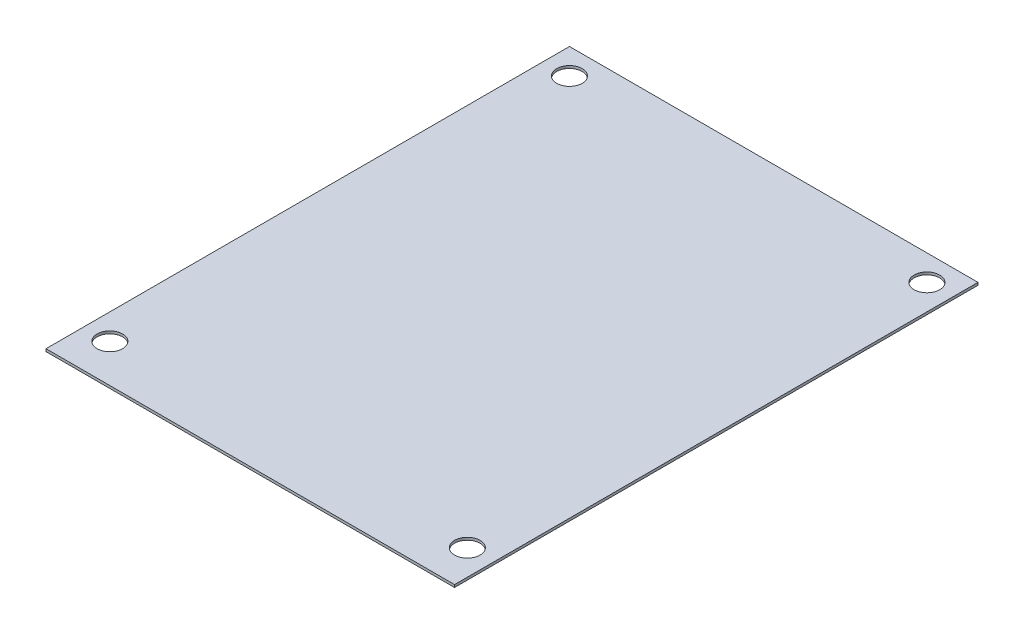
ISO-10303-21;
HEADER;
FILE_DESCRIPTION(('STEP AP214'),'2;1');
FILE_NAME('part.step','',(''),(''),'','','');
FILE_SCHEMA(('AUTOMOTIVE_DESIGN { 1 0 10303 214 1 1 1 1 }'));
ENDSEC;
DATA;
#1=APPLICATION_CONTEXT('core data for automotive mechanical design processes');
#2=APPLICATION_PROTOCOL_DEFINITION('international standard','automotive_design',2000,#1);
#3=PRODUCT_CONTEXT('',#1,'mechanical');
#4=PRODUCT('Part','Part','',(#3));
#5=PRODUCT_RELATED_PRODUCT_CATEGORY('part','',(#4));
#6=PRODUCT_DEFINITION_FORMATION('','',#4);
#7=PRODUCT_DEFINITION_CONTEXT('part definition',#1,'design');
#8=PRODUCT_DEFINITION('design','',#6,#7);
#9=PRODUCT_DEFINITION_SHAPE('','',#8);
#10=(LENGTH_UNIT() NAMED_UNIT(*) SI_UNIT(.MILLI.,.METRE.));
#11=(NAMED_UNIT(*) PLANE_ANGLE_UNIT() SI_UNIT($,.RADIAN.));
#12=(NAMED_UNIT(*) SI_UNIT($,.STERADIAN.) SOLID_ANGLE_UNIT());
#13=UNCERTAINTY_MEASURE_WITH_UNIT(LENGTH_MEASURE(1.E-05),#10,'distance_accuracy_value','');
#14=(GEOMETRIC_REPRESENTATION_CONTEXT(3) GLOBAL_UNCERTAINTY_ASSIGNED_CONTEXT((#13)) GLOBAL_UNIT_ASSIGNED_CONTEXT((#10,
#11,#12)) REPRESENTATION_CONTEXT('',''));
#15=CARTESIAN_POINT('',(0.,0.,0.));
#16=DIRECTION('',(0.,0.,1.));
#17=DIRECTION('',(1.,0.,0.));
#18=AXIS2_PLACEMENT_3D('',#15,#16,#17);
#19=CARTESIAN_POINT('',(0.,2.,0.));
#20=DIRECTION('',(1.,0.,0.));
#21=DIRECTION('',(0.,0.,-1.));
#22=AXIS2_PLACEMENT_3D('',#19,#20,#21);
#23=PLANE('',#22);
#24=DIRECTION('',(0.,0.,1.));
#25=VECTOR('',#24,1.);
#26=CARTESIAN_POINT('',(0.,0.,0.));
#27=LINE('',#26,#25);
#28=CARTESIAN_POINT('',(0.,0.,-410.));
#29=VERTEX_POINT('',#28);
#30=CARTESIAN_POINT('',(0.,0.,0.));
#31=VERTEX_POINT('',#30);
#32=EDGE_CURVE('E98',#29,#31,#27,.T.);
#33=ORIENTED_EDGE('',*,*,#32,.T.);
#34=DIRECTION('',(0.,-1.,0.));
#35=VECTOR('',#34,1.);
#36=CARTESIAN_POINT('',(0.,2.,0.));
#37=LINE('',#36,#35);
#38=CARTESIAN_POINT('',(0.,2.,0.));
#39=VERTEX_POINT('',#38);
#40=EDGE_CURVE('E11',#39,#31,#37,.T.);
#41=ORIENTED_EDGE('',*,*,#40,.F.);
#42=DIRECTION('',(0.,0.,1.));
#43=VECTOR('',#42,1.);
#44=CARTESIAN_POINT('',(0.,2.,0.));
#45=LINE('',#44,#43);
#46=CARTESIAN_POINT('',(0.,2.,-410.));
#47=VERTEX_POINT('',#46);
#48=EDGE_CURVE('E86',#47,#39,#45,.T.);
#49=ORIENTED_EDGE('',*,*,#48,.F.);
#50=DIRECTION('',(0.,-1.,0.));
#51=VECTOR('',#50,1.);
#52=CARTESIAN_POINT('',(0.,2.,-410.));
#53=LINE('',#52,#51);
#54=EDGE_CURVE('E94',#47,#29,#53,.T.);
#55=ORIENTED_EDGE('',*,*,#54,.T.);
#56=EDGE_LOOP('',(#33,#41,#49,#55));
#57=FACE_BOUND('',#56,.T.);
#58=ADVANCED_FACE('F35',(#57),#23,.F.);
#59=CARTESIAN_POINT('',(0.,2.,0.));
#60=DIRECTION('',(0.,0.,-1.));
#61=DIRECTION('',(-1.,0.,0.));
#62=AXIS2_PLACEMENT_3D('',#59,#60,#61);
#63=PLANE('',#62);
#64=DIRECTION('',(1.,0.,0.));
#65=VECTOR('',#64,1.);
#66=CARTESIAN_POINT('',(0.,0.,0.));
#67=LINE('',#66,#65);
#68=CARTESIAN_POINT('',(320.,0.,0.));
#69=VERTEX_POINT('',#68);
#70=EDGE_CURVE('E90',#31,#69,#67,.T.);
#71=ORIENTED_EDGE('',*,*,#70,.T.);
#72=DIRECTION('',(0.,-1.,0.));
#73=VECTOR('',#72,1.);
#74=CARTESIAN_POINT('',(320.,2.,0.));
#75=LINE('',#74,#73);
#76=CARTESIAN_POINT('',(320.,2.,0.));
#77=VERTEX_POINT('',#76);
#78=EDGE_CURVE('E43',#77,#69,#75,.T.);
#79=ORIENTED_EDGE('',*,*,#78,.F.);
#80=DIRECTION('',(1.,0.,0.));
#81=VECTOR('',#80,1.);
#82=CARTESIAN_POINT('',(0.,2.,0.));
#83=LINE('',#82,#81);
#84=EDGE_CURVE('E81',#39,#77,#83,.T.);
#85=ORIENTED_EDGE('',*,*,#84,.F.);
#86=ORIENTED_EDGE('',*,*,#40,.T.);
#87=EDGE_LOOP('',(#71,#79,#85,#86));
#88=FACE_BOUND('',#87,.T.);
#89=ADVANCED_FACE('F89',(#88),#63,.F.);
#90=CARTESIAN_POINT('',(320.,2.,0.));
#91=DIRECTION('',(-1.,0.,0.));
#92=DIRECTION('',(0.,0.,1.));
#93=AXIS2_PLACEMENT_3D('',#90,#91,#92);
#94=PLANE('',#93);
#95=DIRECTION('',(0.,0.,-1.));
#96=VECTOR('',#95,1.);
#97=CARTESIAN_POINT('',(320.,0.,0.));
#98=LINE('',#97,#96);
#99=CARTESIAN_POINT('',(320.,0.,-410.));
#100=VERTEX_POINT('',#99);
#101=EDGE_CURVE('E68',#69,#100,#98,.T.);
#102=ORIENTED_EDGE('',*,*,#101,.T.);
#103=DIRECTION('',(0.,-1.,0.));
#104=VECTOR('',#103,1.);
#105=CARTESIAN_POINT('',(320.,2.,-410.));
#106=LINE('',#105,#104);
#107=CARTESIAN_POINT('',(320.,2.,-410.));
#108=VERTEX_POINT('',#107);
#109=EDGE_CURVE('E91',#108,#100,#106,.T.);
#110=ORIENTED_EDGE('',*,*,#109,.F.);
#111=DIRECTION('',(0.,0.,-1.));
#112=VECTOR('',#111,1.);
#113=CARTESIAN_POINT('',(320.,2.,0.));
#114=LINE('',#113,#112);
#115=EDGE_CURVE('E84',#77,#108,#114,.T.);
#116=ORIENTED_EDGE('',*,*,#115,.F.);
#117=ORIENTED_EDGE('',*,*,#78,.T.);
#118=EDGE_LOOP('',(#102,#110,#116,#117));
#119=FACE_BOUND('',#118,.T.);
#120=ADVANCED_FACE('F92',(#119),#94,.F.);
#121=CARTESIAN_POINT('',(0.,2.,-410.));
#122=DIRECTION('',(0.,0.,1.));
#123=DIRECTION('',(1.,0.,0.));
#124=AXIS2_PLACEMENT_3D('',#121,#122,#123);
#125=PLANE('',#124);
#126=DIRECTION('',(-1.,0.,0.));
#127=VECTOR('',#126,1.);
#128=CARTESIAN_POINT('',(0.,0.,-410.));
#129=LINE('',#128,#127);
#130=EDGE_CURVE('E74',#100,#29,#129,.T.);
#131=ORIENTED_EDGE('',*,*,#130,.T.);
#132=ORIENTED_EDGE('',*,*,#54,.F.);
#133=DIRECTION('',(-1.,0.,0.));
#134=VECTOR('',#133,1.);
#135=CARTESIAN_POINT('',(0.,2.,-410.));
#136=LINE('',#135,#134);
#137=EDGE_CURVE('E51',#108,#47,#136,.T.);
#138=ORIENTED_EDGE('',*,*,#137,.F.);
#139=ORIENTED_EDGE('',*,*,#109,.T.);
#140=EDGE_LOOP('',(#131,#132,#138,#139));
#141=FACE_BOUND('',#140,.T.);
#142=ADVANCED_FACE('F106',(#141),#125,.F.);
#143=CARTESIAN_POINT('',(0.,2.,0.));
#144=DIRECTION('',(0.,-1.,0.));
#145=DIRECTION('',(0.,0.,-1.));
#146=AXIS2_PLACEMENT_3D('',#143,#144,#145);
#147=PLANE('',#146);
#148=CARTESIAN_POINT('',(20.,2.,-30.));
#149=DIRECTION('',(0.,1.,0.));
#150=DIRECTION('',(0.,0.,1.));
#151=AXIS2_PLACEMENT_3D('',#148,#149,#150);
#152=CIRCLE('',#151,10.);
#153=CARTESIAN_POINT('',(20.,2.,-20.));
#154=VERTEX_POINT('',#153);
#155=EDGE_CURVE('E118',#154,#154,#152,.T.);
#156=ORIENTED_EDGE('',*,*,#155,.F.);
#157=EDGE_LOOP('',(#156));
#158=FACE_BOUND('',#157,.T.);
#159=CARTESIAN_POINT('',(300.,2.,-30.));
#160=DIRECTION('',(0.,1.,0.));
#161=DIRECTION('',(0.,0.,1.));
#162=AXIS2_PLACEMENT_3D('',#159,#160,#161);
#163=CIRCLE('',#162,9.99999999999998);
#164=CARTESIAN_POINT('',(300.,2.,-20.));
#165=VERTEX_POINT('',#164);
#166=EDGE_CURVE('E124',#165,#165,#163,.T.);
#167=ORIENTED_EDGE('',*,*,#166,.F.);
#168=EDGE_LOOP('',(#167));
#169=FACE_BOUND('',#168,.T.);
#170=CARTESIAN_POINT('',(300.,2.,-390.));
#171=DIRECTION('',(0.,1.,0.));
#172=DIRECTION('',(0.,0.,1.));
#173=AXIS2_PLACEMENT_3D('',#170,#171,#172);
#174=CIRCLE('',#173,10.);
#175=CARTESIAN_POINT('',(300.,2.,-380.));
#176=VERTEX_POINT('',#175);
#177=EDGE_CURVE('E130',#176,#176,#174,.T.);
#178=ORIENTED_EDGE('',*,*,#177,.F.);
#179=EDGE_LOOP('',(#178));
#180=FACE_BOUND('',#179,.T.);
#181=CARTESIAN_POINT('',(20.,2.,-390.));
#182=DIRECTION('',(0.,1.,0.));
#183=DIRECTION('',(0.,0.,1.));
#184=AXIS2_PLACEMENT_3D('',#181,#182,#183);
#185=CIRCLE('',#184,10.);
#186=CARTESIAN_POINT('',(20.,2.,-380.));
#187=VERTEX_POINT('',#186);
#188=EDGE_CURVE('E112',#187,#187,#185,.T.);
#189=ORIENTED_EDGE('',*,*,#188,.F.);
#190=EDGE_LOOP('',(#189));
#191=FACE_BOUND('',#190,.T.);
#192=ORIENTED_EDGE('',*,*,#48,.T.);
#193=ORIENTED_EDGE('',*,*,#84,.T.);
#194=ORIENTED_EDGE('',*,*,#115,.T.);
#195=ORIENTED_EDGE('',*,*,#137,.T.);
#196=EDGE_LOOP('',(#192,#193,#194,#195));
#197=FACE_BOUND('',#196,.T.);
#198=ADVANCED_FACE('F82',(#158,#169,#180,#191,#197),#147,.F.);
#199=CARTESIAN_POINT('',(0.,0.,0.));
#200=DIRECTION('',(0.,-1.,0.));
#201=DIRECTION('',(0.,0.,-1.));
#202=AXIS2_PLACEMENT_3D('',#199,#200,#201);
#203=PLANE('',#202);
#204=CARTESIAN_POINT('',(20.,0.,-30.));
#205=DIRECTION('',(0.,1.,0.));
#206=DIRECTION('',(0.,0.,1.));
#207=AXIS2_PLACEMENT_3D('',#204,#205,#206);
#208=CIRCLE('',#207,10.);
#209=CARTESIAN_POINT('',(20.,0.,-20.));
#210=VERTEX_POINT('',#209);
#211=EDGE_CURVE('E121',#210,#210,#208,.T.);
#212=ORIENTED_EDGE('',*,*,#211,.T.);
#213=EDGE_LOOP('',(#212));
#214=FACE_BOUND('',#213,.T.);
#215=CARTESIAN_POINT('',(300.,0.,-30.));
#216=DIRECTION('',(0.,1.,0.));
#217=DIRECTION('',(0.,0.,1.));
#218=AXIS2_PLACEMENT_3D('',#215,#216,#217);
#219=CIRCLE('',#218,9.99999999999998);
#220=CARTESIAN_POINT('',(300.,0.,-20.));
#221=VERTEX_POINT('',#220);
#222=EDGE_CURVE('E127',#221,#221,#219,.T.);
#223=ORIENTED_EDGE('',*,*,#222,.T.);
#224=EDGE_LOOP('',(#223));
#225=FACE_BOUND('',#224,.T.);
#226=CARTESIAN_POINT('',(300.,0.,-390.));
#227=DIRECTION('',(0.,1.,0.));
#228=DIRECTION('',(0.,0.,1.));
#229=AXIS2_PLACEMENT_3D('',#226,#227,#228);
#230=CIRCLE('',#229,10.);
#231=CARTESIAN_POINT('',(300.,0.,-380.));
#232=VERTEX_POINT('',#231);
#233=EDGE_CURVE('E115',#232,#232,#230,.T.);
#234=ORIENTED_EDGE('',*,*,#233,.T.);
#235=EDGE_LOOP('',(#234));
#236=FACE_BOUND('',#235,.T.);
#237=CARTESIAN_POINT('',(20.,0.,-390.));
#238=DIRECTION('',(0.,1.,0.));
#239=DIRECTION('',(0.,0.,1.));
#240=AXIS2_PLACEMENT_3D('',#237,#238,#239);
#241=CIRCLE('',#240,10.);
#242=CARTESIAN_POINT('',(20.,0.,-380.));
#243=VERTEX_POINT('',#242);
#244=EDGE_CURVE('E101',#243,#243,#241,.T.);
#245=ORIENTED_EDGE('',*,*,#244,.T.);
#246=EDGE_LOOP('',(#245));
#247=FACE_BOUND('',#246,.T.);
#248=ORIENTED_EDGE('',*,*,#32,.F.);
#249=ORIENTED_EDGE('',*,*,#130,.F.);
#250=ORIENTED_EDGE('',*,*,#101,.F.);
#251=ORIENTED_EDGE('',*,*,#70,.F.);
#252=EDGE_LOOP('',(#248,#249,#250,#251));
#253=FACE_BOUND('',#252,.T.);
#254=ADVANCED_FACE('F109',(#214,#225,#236,#247,#253),#203,.T.);
#255=CARTESIAN_POINT('',(20.,0.,-390.));
#256=DIRECTION('',(0.,1.,0.));
#257=DIRECTION('',(0.,0.,1.));
#258=AXIS2_PLACEMENT_3D('',#255,#256,#257);
#259=CYLINDRICAL_SURFACE('',#258,10.);
#260=ORIENTED_EDGE('',*,*,#244,.F.);
#261=EDGE_LOOP('',(#260));
#262=FACE_BOUND('',#261,.T.);
#263=ORIENTED_EDGE('',*,*,#188,.T.);
#264=EDGE_LOOP('',(#263));
#265=FACE_BOUND('',#264,.T.);
#266=ADVANCED_FACE('F142',(#262,#265),#259,.F.);
#267=CARTESIAN_POINT('',(300.,0.,-390.));
#268=DIRECTION('',(0.,1.,0.));
#269=DIRECTION('',(0.,0.,1.));
#270=AXIS2_PLACEMENT_3D('',#267,#268,#269);
#271=CYLINDRICAL_SURFACE('',#270,10.);
#272=ORIENTED_EDGE('',*,*,#233,.F.);
#273=EDGE_LOOP('',(#272));
#274=FACE_BOUND('',#273,.T.);
#275=ORIENTED_EDGE('',*,*,#177,.T.);
#276=EDGE_LOOP('',(#275));
#277=FACE_BOUND('',#276,.T.);
#278=ADVANCED_FACE('F138',(#274,#277),#271,.F.);
#279=CARTESIAN_POINT('',(300.,0.,-30.));
#280=DIRECTION('',(0.,1.,0.));
#281=DIRECTION('',(0.,0.,1.));
#282=AXIS2_PLACEMENT_3D('',#279,#280,#281);
#283=CYLINDRICAL_SURFACE('',#282,9.99999999999998);
#284=ORIENTED_EDGE('',*,*,#222,.F.);
#285=EDGE_LOOP('',(#284));
#286=FACE_BOUND('',#285,.T.);
#287=ORIENTED_EDGE('',*,*,#166,.T.);
#288=EDGE_LOOP('',(#287));
#289=FACE_BOUND('',#288,.T.);
#290=ADVANCED_FACE('F141',(#286,#289),#283,.F.);
#291=CARTESIAN_POINT('',(20.,0.,-30.));
#292=DIRECTION('',(0.,1.,0.));
#293=DIRECTION('',(0.,0.,1.));
#294=AXIS2_PLACEMENT_3D('',#291,#292,#293);
#295=CYLINDRICAL_SURFACE('',#294,10.);
#296=ORIENTED_EDGE('',*,*,#211,.F.);
#297=EDGE_LOOP('',(#296));
#298=FACE_BOUND('',#297,.T.);
#299=ORIENTED_EDGE('',*,*,#155,.T.);
#300=EDGE_LOOP('',(#299));
#301=FACE_BOUND('',#300,.T.);
#302=ADVANCED_FACE('F203',(#298,#301),#295,.F.);
#303=CLOSED_SHELL('',(#58,#89,#120,#142,#198,#254,#266,#278,#290,#302));
#304=MANIFOLD_SOLID_BREP('B2',#303);
#305=ADVANCED_BREP_SHAPE_REPRESENTATION('',(#18,#304),#14);
#306=SHAPE_DEFINITION_REPRESENTATION(#9,#305);
ENDSEC;
END-ISO-10303-21;
